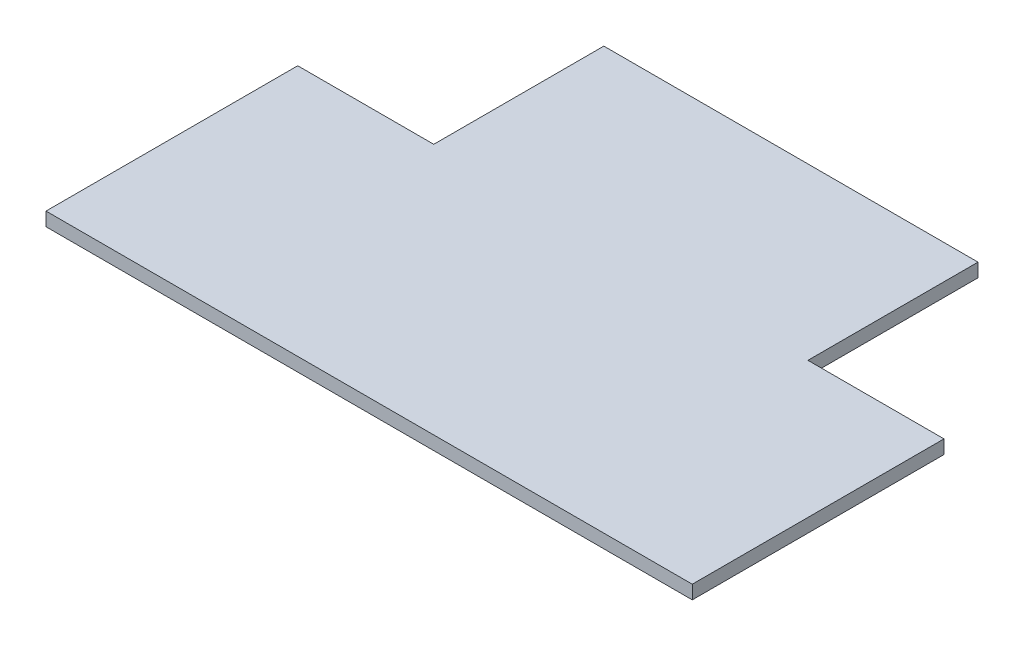
ISO-10303-21;
HEADER;
FILE_DESCRIPTION(('STEP AP214'),'2;1');
FILE_NAME('part.step','',(''),(''),'','','');
FILE_SCHEMA(('AUTOMOTIVE_DESIGN { 1 0 10303 214 1 1 1 1 }'));
ENDSEC;
DATA;
#1=APPLICATION_CONTEXT('core data for automotive mechanical design processes');
#2=APPLICATION_PROTOCOL_DEFINITION('international standard','automotive_design',2000,#1);
#3=PRODUCT_CONTEXT('',#1,'mechanical');
#4=PRODUCT('Part','Part','',(#3));
#5=PRODUCT_RELATED_PRODUCT_CATEGORY('part','',(#4));
#6=PRODUCT_DEFINITION_FORMATION('','',#4);
#7=PRODUCT_DEFINITION_CONTEXT('part definition',#1,'design');
#8=PRODUCT_DEFINITION('design','',#6,#7);
#9=PRODUCT_DEFINITION_SHAPE('','',#8);
#10=(LENGTH_UNIT() NAMED_UNIT(*) SI_UNIT(.MILLI.,.METRE.));
#11=(NAMED_UNIT(*) PLANE_ANGLE_UNIT() SI_UNIT($,.RADIAN.));
#12=(NAMED_UNIT(*) SI_UNIT($,.STERADIAN.) SOLID_ANGLE_UNIT());
#13=UNCERTAINTY_MEASURE_WITH_UNIT(LENGTH_MEASURE(1.E-05),#10,'distance_accuracy_value','');
#14=(GEOMETRIC_REPRESENTATION_CONTEXT(3) GLOBAL_UNCERTAINTY_ASSIGNED_CONTEXT((#13)) GLOBAL_UNIT_ASSIGNED_CONTEXT((#10,
#11,#12)) REPRESENTATION_CONTEXT('',''));
#15=CARTESIAN_POINT('',(0.,0.,0.));
#16=DIRECTION('',(0.,0.,1.));
#17=DIRECTION('',(1.,0.,0.));
#18=AXIS2_PLACEMENT_3D('',#15,#16,#17);
#19=CARTESIAN_POINT('',(-75.,2.,27.3993610223755));
#20=DIRECTION('',(1.,0.,0.));
#21=DIRECTION('',(0.,0.,-1.));
#22=AXIS2_PLACEMENT_3D('',#19,#20,#21);
#23=PLANE('',#22);
#24=DIRECTION('',(0.,0.,1.));
#25=VECTOR('',#24,1.);
#26=CARTESIAN_POINT('',(-75.,0.,27.3993610223755));
#27=LINE('',#26,#25);
#28=CARTESIAN_POINT('',(-75.,0.,-9.60063897763578));
#29=VERTEX_POINT('',#28);
#30=CARTESIAN_POINT('',(-75.,0.,27.3993610223755));
#31=VERTEX_POINT('',#30);
#32=EDGE_CURVE('E129',#29,#31,#27,.T.);
#33=ORIENTED_EDGE('',*,*,#32,.T.);
#34=DIRECTION('',(0.,-1.,0.));
#35=VECTOR('',#34,1.);
#36=CARTESIAN_POINT('',(-75.,2.,27.3993610223755));
#37=LINE('',#36,#35);
#38=CARTESIAN_POINT('',(-75.,2.,27.3993610223755));
#39=VERTEX_POINT('',#38);
#40=EDGE_CURVE('E11',#39,#31,#37,.T.);
#41=ORIENTED_EDGE('',*,*,#40,.F.);
#42=DIRECTION('',(0.,0.,1.));
#43=VECTOR('',#42,1.);
#44=CARTESIAN_POINT('',(-75.,2.,27.3993610223755));
#45=LINE('',#44,#43);
#46=CARTESIAN_POINT('',(-75.,2.,-9.60063897763578));
#47=VERTEX_POINT('',#46);
#48=EDGE_CURVE('E143',#47,#39,#45,.T.);
#49=ORIENTED_EDGE('',*,*,#48,.F.);
#50=DIRECTION('',(0.,-1.,0.));
#51=VECTOR('',#50,1.);
#52=CARTESIAN_POINT('',(-75.,2.,-9.60063897763578));
#53=LINE('',#52,#51);
#54=EDGE_CURVE('E125',#47,#29,#53,.T.);
#55=ORIENTED_EDGE('',*,*,#54,.T.);
#56=EDGE_LOOP('',(#33,#41,#49,#55));
#57=FACE_BOUND('',#56,.T.);
#58=ADVANCED_FACE('F33',(#57),#23,.F.);
#59=CARTESIAN_POINT('',(-75.,2.,27.3993610223755));
#60=DIRECTION('',(0.,0.,-1.));
#61=DIRECTION('',(-1.,0.,0.));
#62=AXIS2_PLACEMENT_3D('',#59,#60,#61);
#63=PLANE('',#62);
#64=DIRECTION('',(1.,0.,0.));
#65=VECTOR('',#64,1.);
#66=CARTESIAN_POINT('',(-75.,0.,27.3993610223755));
#67=LINE('',#66,#65);
#68=CARTESIAN_POINT('',(20.,0.,27.3993610223755));
#69=VERTEX_POINT('',#68);
#70=EDGE_CURVE('E132',#31,#69,#67,.T.);
#71=ORIENTED_EDGE('',*,*,#70,.T.);
#72=DIRECTION('',(0.,-1.,0.));
#73=VECTOR('',#72,1.);
#74=CARTESIAN_POINT('',(20.,2.,27.3993610223755));
#75=LINE('',#74,#73);
#76=CARTESIAN_POINT('',(20.,2.,27.3993610223755));
#77=VERTEX_POINT('',#76);
#78=EDGE_CURVE('E41',#77,#69,#75,.T.);
#79=ORIENTED_EDGE('',*,*,#78,.F.);
#80=DIRECTION('',(1.,0.,0.));
#81=VECTOR('',#80,1.);
#82=CARTESIAN_POINT('',(-75.,2.,27.3993610223755));
#83=LINE('',#82,#81);
#84=EDGE_CURVE('E92',#39,#77,#83,.T.);
#85=ORIENTED_EDGE('',*,*,#84,.F.);
#86=ORIENTED_EDGE('',*,*,#40,.T.);
#87=EDGE_LOOP('',(#71,#79,#85,#86));
#88=FACE_BOUND('',#87,.T.);
#89=ADVANCED_FACE('F178',(#88),#63,.F.);
#90=CARTESIAN_POINT('',(20.,2.,-9.60063897763578));
#91=DIRECTION('',(-1.,0.,0.));
#92=DIRECTION('',(0.,0.,1.));
#93=AXIS2_PLACEMENT_3D('',#90,#91,#92);
#94=PLANE('',#93);
#95=DIRECTION('',(0.,0.,-1.));
#96=VECTOR('',#95,1.);
#97=CARTESIAN_POINT('',(20.,0.,-9.60063897763578));
#98=LINE('',#97,#96);
#99=CARTESIAN_POINT('',(20.,0.,-9.60063897763578));
#100=VERTEX_POINT('',#99);
#101=EDGE_CURVE('E134',#69,#100,#98,.T.);
#102=ORIENTED_EDGE('',*,*,#101,.T.);
#103=DIRECTION('',(0.,-1.,0.));
#104=VECTOR('',#103,1.);
#105=CARTESIAN_POINT('',(20.,2.,-9.60063897763578));
#106=LINE('',#105,#104);
#107=CARTESIAN_POINT('',(20.,2.,-9.60063897763578));
#108=VERTEX_POINT('',#107);
#109=EDGE_CURVE('E150',#108,#100,#106,.T.);
#110=ORIENTED_EDGE('',*,*,#109,.F.);
#111=DIRECTION('',(0.,0.,-1.));
#112=VECTOR('',#111,1.);
#113=CARTESIAN_POINT('',(20.,2.,-9.60063897763578));
#114=LINE('',#113,#112);
#115=EDGE_CURVE('E158',#77,#108,#114,.T.);
#116=ORIENTED_EDGE('',*,*,#115,.F.);
#117=ORIENTED_EDGE('',*,*,#78,.T.);
#118=EDGE_LOOP('',(#102,#110,#116,#117));
#119=FACE_BOUND('',#118,.T.);
#120=ADVANCED_FACE('F156',(#119),#94,.F.);
#121=CARTESIAN_POINT('',(0.,2.,-9.60063897763578));
#122=DIRECTION('',(0.,0.,1.));
#123=DIRECTION('',(1.,0.,0.));
#124=AXIS2_PLACEMENT_3D('',#121,#122,#123);
#125=PLANE('',#124);
#126=DIRECTION('',(-1.,0.,0.));
#127=VECTOR('',#126,1.);
#128=CARTESIAN_POINT('',(0.,0.,-9.60063897763578));
#129=LINE('',#128,#127);
#130=CARTESIAN_POINT('',(0.,0.,-9.60063897763578));
#131=VERTEX_POINT('',#130);
#132=EDGE_CURVE('E136',#100,#131,#129,.T.);
#133=ORIENTED_EDGE('',*,*,#132,.T.);
#134=DIRECTION('',(0.,-1.,0.));
#135=VECTOR('',#134,1.);
#136=CARTESIAN_POINT('',(0.,2.,-9.60063897763578));
#137=LINE('',#136,#135);
#138=CARTESIAN_POINT('',(0.,2.,-9.60063897763578));
#139=VERTEX_POINT('',#138);
#140=EDGE_CURVE('E147',#139,#131,#137,.T.);
#141=ORIENTED_EDGE('',*,*,#140,.F.);
#142=DIRECTION('',(-1.,0.,0.));
#143=VECTOR('',#142,1.);
#144=CARTESIAN_POINT('',(0.,2.,-9.60063897763578));
#145=LINE('',#144,#143);
#146=EDGE_CURVE('E170',#108,#139,#145,.T.);
#147=ORIENTED_EDGE('',*,*,#146,.F.);
#148=ORIENTED_EDGE('',*,*,#109,.T.);
#149=EDGE_LOOP('',(#133,#141,#147,#148));
#150=FACE_BOUND('',#149,.T.);
#151=ADVANCED_FACE('F166',(#150),#125,.F.);
#152=CARTESIAN_POINT('',(0.,2.,-34.6006389776358));
#153=DIRECTION('',(-1.,0.,0.));
#154=DIRECTION('',(0.,0.,1.));
#155=AXIS2_PLACEMENT_3D('',#152,#153,#154);
#156=PLANE('',#155);
#157=DIRECTION('',(0.,0.,-1.));
#158=VECTOR('',#157,1.);
#159=CARTESIAN_POINT('',(0.,0.,-34.6006389776358));
#160=LINE('',#159,#158);
#161=CARTESIAN_POINT('',(0.,0.,-34.6006389776358));
#162=VERTEX_POINT('',#161);
#163=EDGE_CURVE('E138',#131,#162,#160,.T.);
#164=ORIENTED_EDGE('',*,*,#163,.T.);
#165=DIRECTION('',(0.,-1.,0.));
#166=VECTOR('',#165,1.);
#167=CARTESIAN_POINT('',(0.,2.,-34.6006389776358));
#168=LINE('',#167,#166);
#169=CARTESIAN_POINT('',(0.,2.,-34.6006389776358));
#170=VERTEX_POINT('',#169);
#171=EDGE_CURVE('E120',#170,#162,#168,.T.);
#172=ORIENTED_EDGE('',*,*,#171,.F.);
#173=DIRECTION('',(0.,0.,-1.));
#174=VECTOR('',#173,1.);
#175=CARTESIAN_POINT('',(0.,2.,-34.6006389776358));
#176=LINE('',#175,#174);
#177=EDGE_CURVE('E111',#139,#170,#176,.T.);
#178=ORIENTED_EDGE('',*,*,#177,.F.);
#179=ORIENTED_EDGE('',*,*,#140,.T.);
#180=EDGE_LOOP('',(#164,#172,#178,#179));
#181=FACE_BOUND('',#180,.T.);
#182=ADVANCED_FACE('F169',(#181),#156,.F.);
#183=CARTESIAN_POINT('',(-55.,2.,-34.6006389776358));
#184=DIRECTION('',(0.,0.,1.));
#185=DIRECTION('',(1.,0.,0.));
#186=AXIS2_PLACEMENT_3D('',#183,#184,#185);
#187=PLANE('',#186);
#188=DIRECTION('',(-1.,0.,0.));
#189=VECTOR('',#188,1.);
#190=CARTESIAN_POINT('',(-55.,0.,-34.6006389776358));
#191=LINE('',#190,#189);
#192=CARTESIAN_POINT('',(-55.,0.,-34.6006389776358));
#193=VERTEX_POINT('',#192);
#194=EDGE_CURVE('E119',#162,#193,#191,.T.);
#195=ORIENTED_EDGE('',*,*,#194,.T.);
#196=DIRECTION('',(0.,-1.,0.));
#197=VECTOR('',#196,1.);
#198=CARTESIAN_POINT('',(-55.,2.,-34.6006389776358));
#199=LINE('',#198,#197);
#200=CARTESIAN_POINT('',(-55.,2.,-34.6006389776358));
#201=VERTEX_POINT('',#200);
#202=EDGE_CURVE('E116',#201,#193,#199,.T.);
#203=ORIENTED_EDGE('',*,*,#202,.F.);
#204=DIRECTION('',(-1.,0.,0.));
#205=VECTOR('',#204,1.);
#206=CARTESIAN_POINT('',(-55.,2.,-34.6006389776358));
#207=LINE('',#206,#205);
#208=EDGE_CURVE('E105',#170,#201,#207,.T.);
#209=ORIENTED_EDGE('',*,*,#208,.F.);
#210=ORIENTED_EDGE('',*,*,#171,.T.);
#211=EDGE_LOOP('',(#195,#203,#209,#210));
#212=FACE_BOUND('',#211,.T.);
#213=ADVANCED_FACE('F117',(#212),#187,.F.);
#214=CARTESIAN_POINT('',(-55.,2.,-9.60063897763578));
#215=DIRECTION('',(1.,0.,0.));
#216=DIRECTION('',(0.,0.,-1.));
#217=AXIS2_PLACEMENT_3D('',#214,#215,#216);
#218=PLANE('',#217);
#219=DIRECTION('',(0.,0.,1.));
#220=VECTOR('',#219,1.);
#221=CARTESIAN_POINT('',(-55.,0.,-9.60063897763578));
#222=LINE('',#221,#220);
#223=CARTESIAN_POINT('',(-55.,0.,-9.60063897763578));
#224=VERTEX_POINT('',#223);
#225=EDGE_CURVE('E78',#193,#224,#222,.T.);
#226=ORIENTED_EDGE('',*,*,#225,.T.);
#227=DIRECTION('',(0.,-1.,0.));
#228=VECTOR('',#227,1.);
#229=CARTESIAN_POINT('',(-55.,2.,-9.60063897763578));
#230=LINE('',#229,#228);
#231=CARTESIAN_POINT('',(-55.,2.,-9.60063897763578));
#232=VERTEX_POINT('',#231);
#233=EDGE_CURVE('E121',#232,#224,#230,.T.);
#234=ORIENTED_EDGE('',*,*,#233,.F.);
#235=DIRECTION('',(0.,0.,1.));
#236=VECTOR('',#235,1.);
#237=CARTESIAN_POINT('',(-55.,2.,-9.60063897763578));
#238=LINE('',#237,#236);
#239=EDGE_CURVE('E109',#201,#232,#238,.T.);
#240=ORIENTED_EDGE('',*,*,#239,.F.);
#241=ORIENTED_EDGE('',*,*,#202,.T.);
#242=EDGE_LOOP('',(#226,#234,#240,#241));
#243=FACE_BOUND('',#242,.T.);
#244=ADVANCED_FACE('F123',(#243),#218,.F.);
#245=CARTESIAN_POINT('',(-75.,2.,-9.60063897763578));
#246=DIRECTION('',(0.,0.,1.));
#247=DIRECTION('',(1.,0.,0.));
#248=AXIS2_PLACEMENT_3D('',#245,#246,#247);
#249=PLANE('',#248);
#250=DIRECTION('',(-1.,0.,0.));
#251=VECTOR('',#250,1.);
#252=CARTESIAN_POINT('',(-75.,0.,-9.60063897763578));
#253=LINE('',#252,#251);
#254=EDGE_CURVE('E84',#224,#29,#253,.T.);
#255=ORIENTED_EDGE('',*,*,#254,.T.);
#256=ORIENTED_EDGE('',*,*,#54,.F.);
#257=DIRECTION('',(-1.,0.,0.));
#258=VECTOR('',#257,1.);
#259=CARTESIAN_POINT('',(-75.,2.,-9.60063897763578));
#260=LINE('',#259,#258);
#261=EDGE_CURVE('E49',#232,#47,#260,.T.);
#262=ORIENTED_EDGE('',*,*,#261,.F.);
#263=ORIENTED_EDGE('',*,*,#233,.T.);
#264=EDGE_LOOP('',(#255,#256,#262,#263));
#265=FACE_BOUND('',#264,.T.);
#266=ADVANCED_FACE('F194',(#265),#249,.F.);
#267=CARTESIAN_POINT('',(0.,2.,0.));
#268=DIRECTION('',(0.,-1.,0.));
#269=DIRECTION('',(0.,0.,-1.));
#270=AXIS2_PLACEMENT_3D('',#267,#268,#269);
#271=PLANE('',#270);
#272=ORIENTED_EDGE('',*,*,#48,.T.);
#273=ORIENTED_EDGE('',*,*,#84,.T.);
#274=ORIENTED_EDGE('',*,*,#115,.T.);
#275=ORIENTED_EDGE('',*,*,#146,.T.);
#276=ORIENTED_EDGE('',*,*,#177,.T.);
#277=ORIENTED_EDGE('',*,*,#208,.T.);
#278=ORIENTED_EDGE('',*,*,#239,.T.);
#279=ORIENTED_EDGE('',*,*,#261,.T.);
#280=EDGE_LOOP('',(#272,#273,#274,#275,#276,#277,#278,#279));
#281=FACE_BOUND('',#280,.T.);
#282=ADVANCED_FACE('F107',(#281),#271,.F.);
#283=CARTESIAN_POINT('',(0.,0.,0.));
#284=DIRECTION('',(0.,-1.,0.));
#285=DIRECTION('',(0.,0.,-1.));
#286=AXIS2_PLACEMENT_3D('',#283,#284,#285);
#287=PLANE('',#286);
#288=ORIENTED_EDGE('',*,*,#32,.F.);
#289=ORIENTED_EDGE('',*,*,#254,.F.);
#290=ORIENTED_EDGE('',*,*,#225,.F.);
#291=ORIENTED_EDGE('',*,*,#194,.F.);
#292=ORIENTED_EDGE('',*,*,#163,.F.);
#293=ORIENTED_EDGE('',*,*,#132,.F.);
#294=ORIENTED_EDGE('',*,*,#101,.F.);
#295=ORIENTED_EDGE('',*,*,#70,.F.);
#296=EDGE_LOOP('',(#288,#289,#290,#291,#292,#293,#294,#295));
#297=FACE_BOUND('',#296,.T.);
#298=ADVANCED_FACE('F162',(#297),#287,.T.);
#299=CLOSED_SHELL('',(#58,#89,#120,#151,#182,#213,#244,#266,#282,#298));
#300=MANIFOLD_SOLID_BREP('B2',#299);
#301=ADVANCED_BREP_SHAPE_REPRESENTATION('',(#18,#300),#14);
#302=SHAPE_DEFINITION_REPRESENTATION(#9,#301);
ENDSEC;
END-ISO-10303-21;
